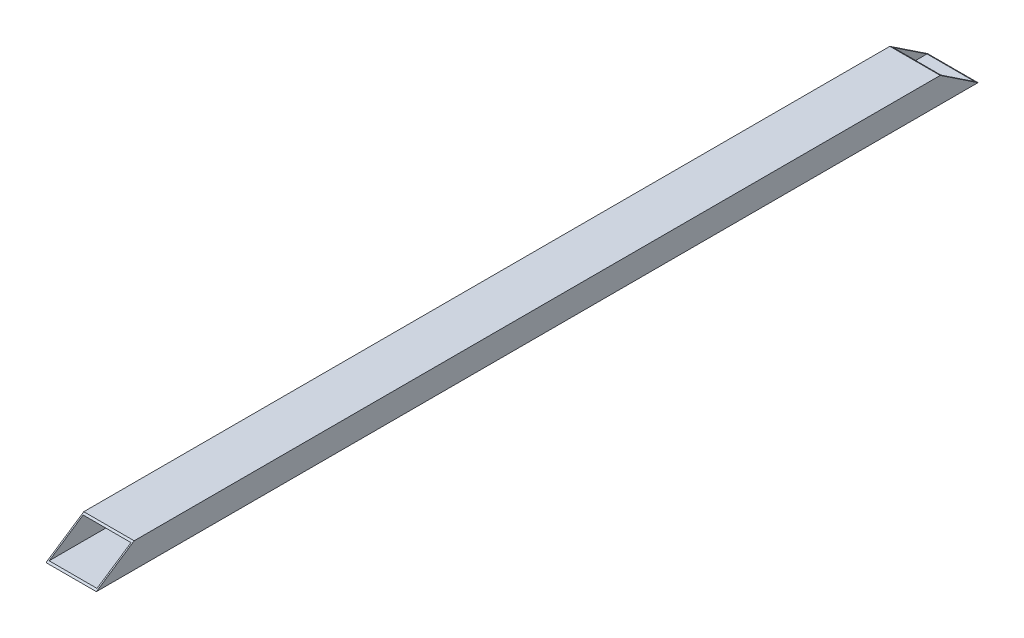
ISO-10303-21;
HEADER;
FILE_DESCRIPTION(('STEP AP214'),'2;1');
FILE_NAME('part.step','',(''),(''),'','','');
FILE_SCHEMA(('AUTOMOTIVE_DESIGN { 1 0 10303 214 1 1 1 1 }'));
ENDSEC;
DATA;
#1=APPLICATION_CONTEXT('core data for automotive mechanical design processes');
#2=APPLICATION_PROTOCOL_DEFINITION('international standard','automotive_design',2000,#1);
#3=PRODUCT_CONTEXT('',#1,'mechanical');
#4=PRODUCT('Part','Part','',(#3));
#5=PRODUCT_RELATED_PRODUCT_CATEGORY('part','',(#4));
#6=PRODUCT_DEFINITION_FORMATION('','',#4);
#7=PRODUCT_DEFINITION_CONTEXT('part definition',#1,'design');
#8=PRODUCT_DEFINITION('design','',#6,#7);
#9=PRODUCT_DEFINITION_SHAPE('','',#8);
#10=(LENGTH_UNIT() NAMED_UNIT(*) SI_UNIT(.MILLI.,.METRE.));
#11=(NAMED_UNIT(*) PLANE_ANGLE_UNIT() SI_UNIT($,.RADIAN.));
#12=(NAMED_UNIT(*) SI_UNIT($,.STERADIAN.) SOLID_ANGLE_UNIT());
#13=UNCERTAINTY_MEASURE_WITH_UNIT(LENGTH_MEASURE(1.E-05),#10,'distance_accuracy_value','');
#14=(GEOMETRIC_REPRESENTATION_CONTEXT(3) GLOBAL_UNCERTAINTY_ASSIGNED_CONTEXT((#13)) GLOBAL_UNIT_ASSIGNED_CONTEXT((#10,
#11,#12)) REPRESENTATION_CONTEXT('',''));
#15=CARTESIAN_POINT('',(0.,0.,0.));
#16=DIRECTION('',(0.,0.,1.));
#17=DIRECTION('',(1.,0.,0.));
#18=AXIS2_PLACEMENT_3D('',#15,#16,#17);
#19=CARTESIAN_POINT('',(-19.,11.,0.));
#20=DIRECTION('',(-1.,0.,0.));
#21=DIRECTION('',(0.,0.,1.));
#22=AXIS2_PLACEMENT_3D('',#19,#20,#21);
#23=PLANE('',#22);
#24=DIRECTION('',(0.,0.,1.));
#25=VECTOR('',#24,1.);
#26=CARTESIAN_POINT('',(-19.,-7.,0.));
#27=LINE('',#26,#25);
#28=CARTESIAN_POINT('',(-19.,-7.,1.50000000000001));
#29=VERTEX_POINT('',#28);
#30=CARTESIAN_POINT('',(-19.,-7.,698.5));
#31=VERTEX_POINT('',#30);
#32=EDGE_CURVE('E149',#29,#31,#27,.T.);
#33=ORIENTED_EDGE('',*,*,#32,.F.);
#34=DIRECTION('',(0.,0.554700196225229,0.832050294337844));
#35=VECTOR('',#34,1.);
#36=CARTESIAN_POINT('',(-19.,-2.15384615384616,8.76923076923077));
#37=LINE('',#36,#35);
#38=CARTESIAN_POINT('',(-19.,11.,28.5));
#39=VERTEX_POINT('',#38);
#40=EDGE_CURVE('E11',#29,#39,#37,.T.);
#41=ORIENTED_EDGE('',*,*,#40,.T.);
#42=DIRECTION('',(0.,0.,1.));
#43=VECTOR('',#42,1.);
#44=CARTESIAN_POINT('',(-19.,11.,0.));
#45=LINE('',#44,#43);
#46=CARTESIAN_POINT('',(-19.,11.,671.5));
#47=VERTEX_POINT('',#46);
#48=EDGE_CURVE('E151',#39,#47,#45,.T.);
#49=ORIENTED_EDGE('',*,*,#48,.T.);
#50=DIRECTION('',(0.,-0.554700196225229,0.832050294337844));
#51=VECTOR('',#50,1.);
#52=CARTESIAN_POINT('',(-19.,320.923076923077,206.615384615384));
#53=LINE('',#52,#51);
#54=EDGE_CURVE('E48',#47,#31,#53,.T.);
#55=ORIENTED_EDGE('',*,*,#54,.T.);
#56=EDGE_LOOP('',(#33,#41,#49,#55));
#57=FACE_BOUND('',#56,.T.);
#58=ADVANCED_FACE('F39',(#57),#23,.F.);
#59=CARTESIAN_POINT('',(-19.,-7.,0.));
#60=DIRECTION('',(0.,-1.,0.));
#61=DIRECTION('',(1.,0.,0.));
#62=AXIS2_PLACEMENT_3D('',#59,#60,#61);
#63=PLANE('',#62);
#64=DIRECTION('',(0.,0.,1.));
#65=VECTOR('',#64,1.);
#66=CARTESIAN_POINT('',(19.,-6.99999999999999,0.));
#67=LINE('',#66,#65);
#68=CARTESIAN_POINT('',(19.,-6.99999999999999,1.50000000000002));
#69=VERTEX_POINT('',#68);
#70=CARTESIAN_POINT('',(19.,-6.99999999999999,698.5));
#71=VERTEX_POINT('',#70);
#72=EDGE_CURVE('E160',#69,#71,#67,.T.);
#73=ORIENTED_EDGE('',*,*,#72,.F.);
#74=DIRECTION('',(-1.,0.,0.));
#75=VECTOR('',#74,1.);
#76=CARTESIAN_POINT('',(-19.,-7.,1.5));
#77=LINE('',#76,#75);
#78=EDGE_CURVE('E158',#69,#29,#77,.T.);
#79=ORIENTED_EDGE('',*,*,#78,.T.);
#80=ORIENTED_EDGE('',*,*,#32,.T.);
#81=DIRECTION('',(1.,0.,0.));
#82=VECTOR('',#81,1.);
#83=CARTESIAN_POINT('',(-18.9999999999998,-7.,698.5));
#84=LINE('',#83,#82);
#85=EDGE_CURVE('E62',#31,#71,#84,.T.);
#86=ORIENTED_EDGE('',*,*,#85,.T.);
#87=EDGE_LOOP('',(#73,#79,#80,#86));
#88=FACE_BOUND('',#87,.T.);
#89=ADVANCED_FACE('F156',(#88),#63,.F.);
#90=CARTESIAN_POINT('',(19.,-6.99999999999999,0.));
#91=DIRECTION('',(1.,0.,0.));
#92=DIRECTION('',(0.,0.,-1.));
#93=AXIS2_PLACEMENT_3D('',#90,#91,#92);
#94=PLANE('',#93);
#95=DIRECTION('',(0.,0.,1.));
#96=VECTOR('',#95,1.);
#97=CARTESIAN_POINT('',(19.,11.,0.));
#98=LINE('',#97,#96);
#99=CARTESIAN_POINT('',(19.,11.,28.5));
#100=VERTEX_POINT('',#99);
#101=CARTESIAN_POINT('',(19.,11.,671.5));
#102=VERTEX_POINT('',#101);
#103=EDGE_CURVE('E164',#100,#102,#98,.T.);
#104=ORIENTED_EDGE('',*,*,#103,.F.);
#105=DIRECTION('',(0.,-0.554700196225229,-0.832050294337844));
#106=VECTOR('',#105,1.);
#107=CARTESIAN_POINT('',(19.,-7.69230769230769,0.461538461538465));
#108=LINE('',#107,#106);
#109=EDGE_CURVE('E173',#100,#69,#108,.T.);
#110=ORIENTED_EDGE('',*,*,#109,.T.);
#111=ORIENTED_EDGE('',*,*,#72,.T.);
#112=DIRECTION('',(0.,0.554700196225229,-0.832050294337844));
#113=VECTOR('',#112,1.);
#114=CARTESIAN_POINT('',(19.,315.384615384615,214.923076923077));
#115=LINE('',#114,#113);
#116=EDGE_CURVE('E182',#71,#102,#115,.T.);
#117=ORIENTED_EDGE('',*,*,#116,.T.);
#118=EDGE_LOOP('',(#104,#110,#111,#117));
#119=FACE_BOUND('',#118,.T.);
#120=ADVANCED_FACE('F212',(#119),#94,.F.);
#121=CARTESIAN_POINT('',(19.,11.,0.));
#122=DIRECTION('',(0.,1.,0.));
#123=DIRECTION('',(0.,0.,1.));
#124=AXIS2_PLACEMENT_3D('',#121,#122,#123);
#125=PLANE('',#124);
#126=ORIENTED_EDGE('',*,*,#48,.F.);
#127=DIRECTION('',(1.,0.,0.));
#128=VECTOR('',#127,1.);
#129=CARTESIAN_POINT('',(19.,11.,28.5));
#130=LINE('',#129,#128);
#131=EDGE_CURVE('E55',#39,#100,#130,.T.);
#132=ORIENTED_EDGE('',*,*,#131,.T.);
#133=ORIENTED_EDGE('',*,*,#103,.T.);
#134=DIRECTION('',(-1.,0.,0.));
#135=VECTOR('',#134,1.);
#136=CARTESIAN_POINT('',(19.,11.,671.5));
#137=LINE('',#136,#135);
#138=EDGE_CURVE('E179',#102,#47,#137,.T.);
#139=ORIENTED_EDGE('',*,*,#138,.T.);
#140=EDGE_LOOP('',(#126,#132,#133,#139));
#141=FACE_BOUND('',#140,.T.);
#142=ADVANCED_FACE('F208',(#141),#125,.F.);
#143=CARTESIAN_POINT('',(20.,-8.,700.));
#144=DIRECTION('',(0.,-0.832050294337844,-0.554700196225229));
#145=DIRECTION('',(0.,0.554700196225229,-0.832050294337844));
#146=AXIS2_PLACEMENT_3D('',#143,#144,#145);
#147=PLANE('',#146);
#148=DIRECTION('',(0.,-0.554700196225229,0.832050294337844));
#149=VECTOR('',#148,1.);
#150=CARTESIAN_POINT('',(-20.,-8.,700.));
#151=LINE('',#150,#149);
#152=CARTESIAN_POINT('',(-20.,12.,670.));
#153=VERTEX_POINT('',#152);
#154=CARTESIAN_POINT('',(-20.,-8.,700.));
#155=VERTEX_POINT('',#154);
#156=EDGE_CURVE('E191',#153,#155,#151,.T.);
#157=ORIENTED_EDGE('',*,*,#156,.T.);
#158=DIRECTION('',(1.,0.,0.));
#159=VECTOR('',#158,1.);
#160=CARTESIAN_POINT('',(0.,-8.,700.));
#161=LINE('',#160,#159);
#162=CARTESIAN_POINT('',(20.,-8.,700.));
#163=VERTEX_POINT('',#162);
#164=EDGE_CURVE('E129',#155,#163,#161,.T.);
#165=ORIENTED_EDGE('',*,*,#164,.T.);
#166=DIRECTION('',(0.,-0.554700196225229,0.832050294337844));
#167=VECTOR('',#166,1.);
#168=CARTESIAN_POINT('',(20.,-8.,700.));
#169=LINE('',#168,#167);
#170=CARTESIAN_POINT('',(20.,12.,670.));
#171=VERTEX_POINT('',#170);
#172=EDGE_CURVE('E190',#171,#163,#169,.T.);
#173=ORIENTED_EDGE('',*,*,#172,.F.);
#174=DIRECTION('',(-1.,0.,0.));
#175=VECTOR('',#174,1.);
#176=CARTESIAN_POINT('',(20.,12.,670.));
#177=LINE('',#176,#175);
#178=EDGE_CURVE('E127',#171,#153,#177,.T.);
#179=ORIENTED_EDGE('',*,*,#178,.T.);
#180=EDGE_LOOP('',(#157,#165,#173,#179));
#181=FACE_BOUND('',#180,.T.);
#182=ORIENTED_EDGE('',*,*,#116,.F.);
#183=ORIENTED_EDGE('',*,*,#85,.F.);
#184=ORIENTED_EDGE('',*,*,#54,.F.);
#185=ORIENTED_EDGE('',*,*,#138,.F.);
#186=EDGE_LOOP('',(#182,#183,#184,#185));
#187=FACE_BOUND('',#186,.T.);
#188=ADVANCED_FACE('F206',(#181,#187),#147,.F.);
#189=CARTESIAN_POINT('',(20.,12.,30.));
#190=DIRECTION('',(0.,-0.832050294337844,0.554700196225229));
#191=DIRECTION('',(0.,-0.554700196225229,-0.832050294337844));
#192=AXIS2_PLACEMENT_3D('',#189,#190,#191);
#193=PLANE('',#192);
#194=DIRECTION('',(0.,0.554700196225229,0.832050294337843));
#195=VECTOR('',#194,1.);
#196=CARTESIAN_POINT('',(-20.,12.,30.));
#197=LINE('',#196,#195);
#198=CARTESIAN_POINT('',(-20.,-8.,0.));
#199=VERTEX_POINT('',#198);
#200=CARTESIAN_POINT('',(-20.,12.,30.));
#201=VERTEX_POINT('',#200);
#202=EDGE_CURVE('E109',#199,#201,#197,.T.);
#203=ORIENTED_EDGE('',*,*,#202,.T.);
#204=DIRECTION('',(-1.,0.,0.));
#205=VECTOR('',#204,1.);
#206=CARTESIAN_POINT('',(20.,12.,30.));
#207=LINE('',#206,#205);
#208=CARTESIAN_POINT('',(20.,12.,30.));
#209=VERTEX_POINT('',#208);
#210=EDGE_CURVE('E103',#209,#201,#207,.T.);
#211=ORIENTED_EDGE('',*,*,#210,.F.);
#212=DIRECTION('',(0.,0.554700196225229,0.832050294337843));
#213=VECTOR('',#212,1.);
#214=CARTESIAN_POINT('',(20.,12.,30.));
#215=LINE('',#214,#213);
#216=CARTESIAN_POINT('',(20.,-7.99999999999999,0.));
#217=VERTEX_POINT('',#216);
#218=EDGE_CURVE('E106',#217,#209,#215,.T.);
#219=ORIENTED_EDGE('',*,*,#218,.F.);
#220=DIRECTION('',(1.,0.,0.));
#221=VECTOR('',#220,1.);
#222=CARTESIAN_POINT('',(20.,-7.99999999999999,0.));
#223=LINE('',#222,#221);
#224=EDGE_CURVE('E135',#199,#217,#223,.T.);
#225=ORIENTED_EDGE('',*,*,#224,.F.);
#226=EDGE_LOOP('',(#203,#211,#219,#225));
#227=FACE_BOUND('',#226,.T.);
#228=ORIENTED_EDGE('',*,*,#40,.F.);
#229=ORIENTED_EDGE('',*,*,#78,.F.);
#230=ORIENTED_EDGE('',*,*,#109,.F.);
#231=ORIENTED_EDGE('',*,*,#131,.F.);
#232=EDGE_LOOP('',(#228,#229,#230,#231));
#233=FACE_BOUND('',#232,.T.);
#234=ADVANCED_FACE('F105',(#227,#233),#193,.F.);
#235=CARTESIAN_POINT('',(-20.,12.,700.));
#236=DIRECTION('',(0.,-1.,0.));
#237=DIRECTION('',(0.,0.,-1.));
#238=AXIS2_PLACEMENT_3D('',#235,#236,#237);
#239=PLANE('',#238);
#240=DIRECTION('',(0.,0.,-1.));
#241=VECTOR('',#240,1.);
#242=CARTESIAN_POINT('',(20.,12.,700.));
#243=LINE('',#242,#241);
#244=EDGE_CURVE('E121',#171,#209,#243,.T.);
#245=ORIENTED_EDGE('',*,*,#244,.T.);
#246=ORIENTED_EDGE('',*,*,#210,.T.);
#247=DIRECTION('',(0.,0.,-1.));
#248=VECTOR('',#247,1.);
#249=CARTESIAN_POINT('',(-20.,12.,700.));
#250=LINE('',#249,#248);
#251=EDGE_CURVE('E142',#153,#201,#250,.T.);
#252=ORIENTED_EDGE('',*,*,#251,.F.);
#253=ORIENTED_EDGE('',*,*,#178,.F.);
#254=EDGE_LOOP('',(#245,#246,#252,#253));
#255=FACE_BOUND('',#254,.T.);
#256=ADVANCED_FACE('F41',(#255),#239,.F.);
#257=CARTESIAN_POINT('',(-20.,-8.,700.));
#258=DIRECTION('',(1.,0.,0.));
#259=DIRECTION('',(0.,0.,-1.));
#260=AXIS2_PLACEMENT_3D('',#257,#258,#259);
#261=PLANE('',#260);
#262=ORIENTED_EDGE('',*,*,#251,.T.);
#263=ORIENTED_EDGE('',*,*,#202,.F.);
#264=DIRECTION('',(0.,0.,-1.));
#265=VECTOR('',#264,1.);
#266=CARTESIAN_POINT('',(-20.,-8.,700.));
#267=LINE('',#266,#265);
#268=EDGE_CURVE('E133',#155,#199,#267,.T.);
#269=ORIENTED_EDGE('',*,*,#268,.F.);
#270=ORIENTED_EDGE('',*,*,#156,.F.);
#271=EDGE_LOOP('',(#262,#263,#269,#270));
#272=FACE_BOUND('',#271,.T.);
#273=ADVANCED_FACE('F204',(#272),#261,.F.);
#274=CARTESIAN_POINT('',(20.,-7.99999999999999,700.));
#275=DIRECTION('',(0.,1.,0.));
#276=DIRECTION('',(-1.,0.,0.));
#277=AXIS2_PLACEMENT_3D('',#274,#275,#276);
#278=PLANE('',#277);
#279=ORIENTED_EDGE('',*,*,#224,.T.);
#280=DIRECTION('',(0.,0.,-1.));
#281=VECTOR('',#280,1.);
#282=CARTESIAN_POINT('',(20.,-7.99999999999999,700.));
#283=LINE('',#282,#281);
#284=EDGE_CURVE('E123',#163,#217,#283,.T.);
#285=ORIENTED_EDGE('',*,*,#284,.F.);
#286=ORIENTED_EDGE('',*,*,#164,.F.);
#287=ORIENTED_EDGE('',*,*,#268,.T.);
#288=EDGE_LOOP('',(#279,#285,#286,#287));
#289=FACE_BOUND('',#288,.T.);
#290=ADVANCED_FACE('F200',(#289),#278,.F.);
#291=CARTESIAN_POINT('',(20.,-7.99999999999999,700.));
#292=DIRECTION('',(-1.,0.,0.));
#293=DIRECTION('',(0.,0.,1.));
#294=AXIS2_PLACEMENT_3D('',#291,#292,#293);
#295=PLANE('',#294);
#296=ORIENTED_EDGE('',*,*,#284,.T.);
#297=ORIENTED_EDGE('',*,*,#218,.T.);
#298=ORIENTED_EDGE('',*,*,#244,.F.);
#299=ORIENTED_EDGE('',*,*,#172,.T.);
#300=EDGE_LOOP('',(#296,#297,#298,#299));
#301=FACE_BOUND('',#300,.T.);
#302=ADVANCED_FACE('F119',(#301),#295,.F.);
#303=CLOSED_SHELL('',(#58,#89,#120,#142,#188,#234,#256,#273,#290,#302));
#304=MANIFOLD_SOLID_BREP('B2',#303);
#305=ADVANCED_BREP_SHAPE_REPRESENTATION('',(#18,#304),#14);
#306=SHAPE_DEFINITION_REPRESENTATION(#9,#305);
ENDSEC;
END-ISO-10303-21;
